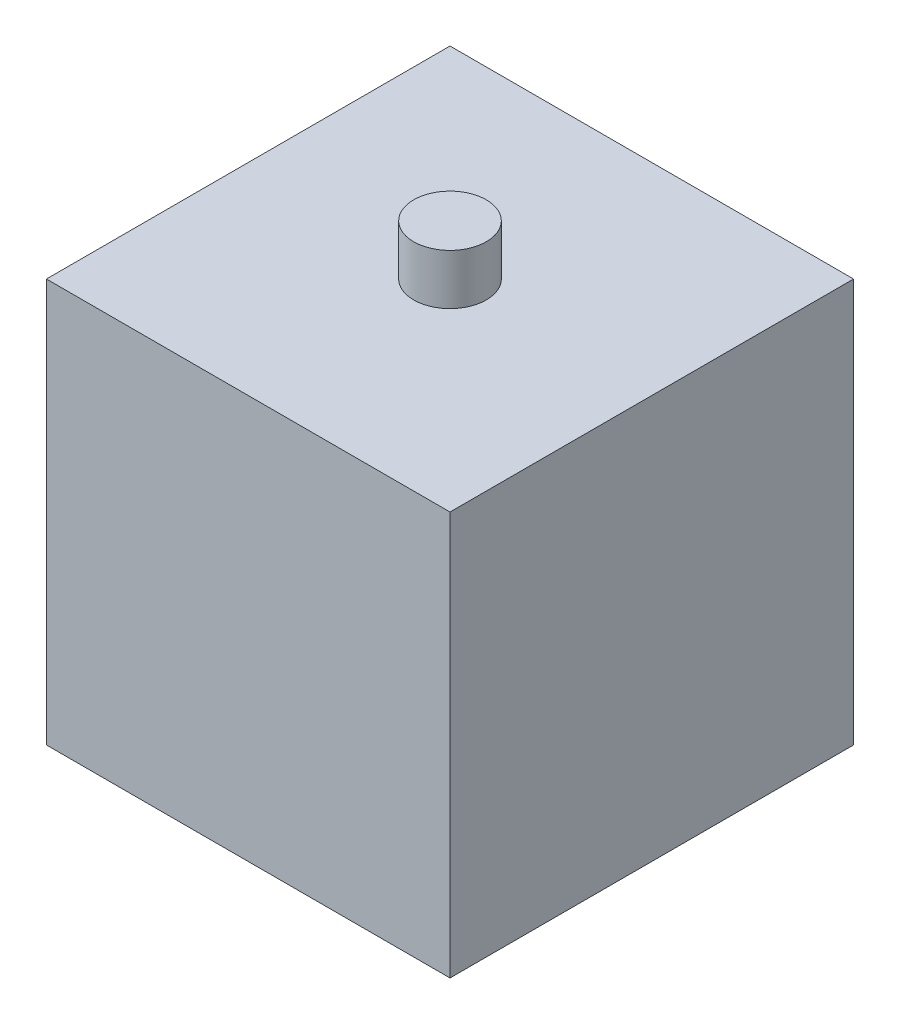
ISO-10303-21;
HEADER;
FILE_DESCRIPTION(('STEP AP214'),'2;1');
FILE_NAME('part.step','',(''),(''),'','','');
FILE_SCHEMA(('AUTOMOTIVE_DESIGN { 1 0 10303 214 1 1 1 1 }'));
ENDSEC;
DATA;
#1=APPLICATION_CONTEXT('core data for automotive mechanical design processes');
#2=APPLICATION_PROTOCOL_DEFINITION('international standard','automotive_design',2000,#1);
#3=PRODUCT_CONTEXT('',#1,'mechanical');
#4=PRODUCT('Part','Part','',(#3));
#5=PRODUCT_RELATED_PRODUCT_CATEGORY('part','',(#4));
#6=PRODUCT_DEFINITION_FORMATION('','',#4);
#7=PRODUCT_DEFINITION_CONTEXT('part definition',#1,'design');
#8=PRODUCT_DEFINITION('design','',#6,#7);
#9=PRODUCT_DEFINITION_SHAPE('','',#8);
#10=(LENGTH_UNIT() NAMED_UNIT(*) SI_UNIT(.MILLI.,.METRE.));
#11=(NAMED_UNIT(*) PLANE_ANGLE_UNIT() SI_UNIT($,.RADIAN.));
#12=(NAMED_UNIT(*) SI_UNIT($,.STERADIAN.) SOLID_ANGLE_UNIT());
#13=UNCERTAINTY_MEASURE_WITH_UNIT(LENGTH_MEASURE(1.E-05),#10,'distance_accuracy_value','');
#14=(GEOMETRIC_REPRESENTATION_CONTEXT(3) GLOBAL_UNCERTAINTY_ASSIGNED_CONTEXT((#13)) GLOBAL_UNIT_ASSIGNED_CONTEXT((#10,
#11,#12)) REPRESENTATION_CONTEXT('',''));
#15=CARTESIAN_POINT('',(0.,0.,0.));
#16=DIRECTION('',(0.,0.,1.));
#17=DIRECTION('',(1.,0.,0.));
#18=AXIS2_PLACEMENT_3D('',#15,#16,#17);
#19=CARTESIAN_POINT('',(-12.7,12.7,12.7));
#20=DIRECTION('',(0.,0.,-1.));
#21=DIRECTION('',(-1.,0.,0.));
#22=AXIS2_PLACEMENT_3D('',#19,#20,#21);
#23=PLANE('',#22);
#24=DIRECTION('',(1.,0.,0.));
#25=VECTOR('',#24,1.);
#26=CARTESIAN_POINT('',(-12.7,-12.7,12.7));
#27=LINE('',#26,#25);
#28=CARTESIAN_POINT('',(-12.7,-12.7,12.7));
#29=VERTEX_POINT('',#28);
#30=CARTESIAN_POINT('',(12.7,-12.7,12.7));
#31=VERTEX_POINT('',#30);
#32=EDGE_CURVE('E97',#29,#31,#27,.T.);
#33=ORIENTED_EDGE('',*,*,#32,.T.);
#34=DIRECTION('',(0.,-1.,0.));
#35=VECTOR('',#34,1.);
#36=CARTESIAN_POINT('',(12.7,12.7,12.7));
#37=LINE('',#36,#35);
#38=CARTESIAN_POINT('',(12.7,12.7,12.7));
#39=VERTEX_POINT('',#38);
#40=EDGE_CURVE('E11',#39,#31,#37,.T.);
#41=ORIENTED_EDGE('',*,*,#40,.F.);
#42=DIRECTION('',(1.,0.,0.));
#43=VECTOR('',#42,1.);
#44=CARTESIAN_POINT('',(-12.7,12.7,12.7));
#45=LINE('',#44,#43);
#46=CARTESIAN_POINT('',(-12.7,12.7,12.7));
#47=VERTEX_POINT('',#46);
#48=EDGE_CURVE('E83',#47,#39,#45,.T.);
#49=ORIENTED_EDGE('',*,*,#48,.F.);
#50=DIRECTION('',(0.,-1.,0.));
#51=VECTOR('',#50,1.);
#52=CARTESIAN_POINT('',(-12.7,12.7,12.7));
#53=LINE('',#52,#51);
#54=EDGE_CURVE('E50',#47,#29,#53,.T.);
#55=ORIENTED_EDGE('',*,*,#54,.T.);
#56=EDGE_LOOP('',(#33,#41,#49,#55));
#57=FACE_BOUND('',#56,.T.);
#58=ADVANCED_FACE('F34',(#57),#23,.F.);
#59=CARTESIAN_POINT('',(12.7,12.7,12.7));
#60=DIRECTION('',(-1.,0.,0.));
#61=DIRECTION('',(0.,0.,1.));
#62=AXIS2_PLACEMENT_3D('',#59,#60,#61);
#63=PLANE('',#62);
#64=DIRECTION('',(0.,0.,-1.));
#65=VECTOR('',#64,1.);
#66=CARTESIAN_POINT('',(12.7,-12.7,12.7));
#67=LINE('',#66,#65);
#68=CARTESIAN_POINT('',(12.7,-12.7,-12.7));
#69=VERTEX_POINT('',#68);
#70=EDGE_CURVE('E88',#31,#69,#67,.T.);
#71=ORIENTED_EDGE('',*,*,#70,.T.);
#72=DIRECTION('',(0.,-1.,0.));
#73=VECTOR('',#72,1.);
#74=CARTESIAN_POINT('',(12.7,12.7,-12.7));
#75=LINE('',#74,#73);
#76=CARTESIAN_POINT('',(12.7,12.7,-12.7));
#77=VERTEX_POINT('',#76);
#78=EDGE_CURVE('E42',#77,#69,#75,.T.);
#79=ORIENTED_EDGE('',*,*,#78,.F.);
#80=DIRECTION('',(0.,0.,-1.));
#81=VECTOR('',#80,1.);
#82=CARTESIAN_POINT('',(12.7,12.7,12.7));
#83=LINE('',#82,#81);
#84=EDGE_CURVE('E75',#39,#77,#83,.T.);
#85=ORIENTED_EDGE('',*,*,#84,.F.);
#86=ORIENTED_EDGE('',*,*,#40,.T.);
#87=EDGE_LOOP('',(#71,#79,#85,#86));
#88=FACE_BOUND('',#87,.T.);
#89=ADVANCED_FACE('F87',(#88),#63,.F.);
#90=CARTESIAN_POINT('',(-12.7,12.7,-12.7));
#91=DIRECTION('',(0.,0.,-1.));
#92=DIRECTION('',(-1.,0.,0.));
#93=AXIS2_PLACEMENT_3D('',#90,#91,#92);
#94=PLANE('',#93);
#95=DIRECTION('',(1.,0.,0.));
#96=VECTOR('',#95,1.);
#97=CARTESIAN_POINT('',(-12.7,-12.7,-12.7));
#98=LINE('',#97,#96);
#99=CARTESIAN_POINT('',(-12.7,-12.7,-12.7));
#100=VERTEX_POINT('',#99);
#101=EDGE_CURVE('E101',#100,#69,#98,.T.);
#102=ORIENTED_EDGE('',*,*,#101,.F.);
#103=DIRECTION('',(0.,-1.,0.));
#104=VECTOR('',#103,1.);
#105=CARTESIAN_POINT('',(-12.7,12.7,-12.7));
#106=LINE('',#105,#104);
#107=CARTESIAN_POINT('',(-12.7,12.7,-12.7));
#108=VERTEX_POINT('',#107);
#109=EDGE_CURVE('E64',#108,#100,#106,.T.);
#110=ORIENTED_EDGE('',*,*,#109,.F.);
#111=DIRECTION('',(1.,0.,0.));
#112=VECTOR('',#111,1.);
#113=CARTESIAN_POINT('',(-12.7,12.7,-12.7));
#114=LINE('',#113,#112);
#115=EDGE_CURVE('E82',#108,#77,#114,.T.);
#116=ORIENTED_EDGE('',*,*,#115,.T.);
#117=ORIENTED_EDGE('',*,*,#78,.T.);
#118=EDGE_LOOP('',(#102,#110,#116,#117));
#119=FACE_BOUND('',#118,.T.);
#120=ADVANCED_FACE('F91',(#119),#94,.T.);
#121=CARTESIAN_POINT('',(-12.7,12.7,12.7));
#122=DIRECTION('',(-1.,0.,0.));
#123=DIRECTION('',(0.,0.,1.));
#124=AXIS2_PLACEMENT_3D('',#121,#122,#123);
#125=PLANE('',#124);
#126=DIRECTION('',(0.,0.,-1.));
#127=VECTOR('',#126,1.);
#128=CARTESIAN_POINT('',(-12.7,-12.7,12.7));
#129=LINE('',#128,#127);
#130=EDGE_CURVE('E103',#29,#100,#129,.T.);
#131=ORIENTED_EDGE('',*,*,#130,.F.);
#132=ORIENTED_EDGE('',*,*,#54,.F.);
#133=DIRECTION('',(0.,0.,-1.));
#134=VECTOR('',#133,1.);
#135=CARTESIAN_POINT('',(-12.7,12.7,12.7));
#136=LINE('',#135,#134);
#137=EDGE_CURVE('E92',#47,#108,#136,.T.);
#138=ORIENTED_EDGE('',*,*,#137,.T.);
#139=ORIENTED_EDGE('',*,*,#109,.T.);
#140=EDGE_LOOP('',(#131,#132,#138,#139));
#141=FACE_BOUND('',#140,.T.);
#142=ADVANCED_FACE('F125',(#141),#125,.T.);
#143=CARTESIAN_POINT('',(0.,12.7,0.));
#144=DIRECTION('',(0.,1.,0.));
#145=DIRECTION('',(0.,0.,1.));
#146=AXIS2_PLACEMENT_3D('',#143,#144,#145);
#147=PLANE('',#146);
#148=CARTESIAN_POINT('',(0.,12.7,0.));
#149=DIRECTION('',(0.,1.,0.));
#150=DIRECTION('',(0.,0.,1.));
#151=AXIS2_PLACEMENT_3D('',#148,#149,#150);
#152=CIRCLE('',#151,2.286);
#153=CARTESIAN_POINT('',(0.,12.7,2.286));
#154=VERTEX_POINT('',#153);
#155=EDGE_CURVE('E109',#154,#154,#152,.T.);
#156=ORIENTED_EDGE('',*,*,#155,.F.);
#157=EDGE_LOOP('',(#156));
#158=FACE_BOUND('',#157,.T.);
#159=ORIENTED_EDGE('',*,*,#48,.T.);
#160=ORIENTED_EDGE('',*,*,#84,.T.);
#161=ORIENTED_EDGE('',*,*,#115,.F.);
#162=ORIENTED_EDGE('',*,*,#137,.F.);
#163=EDGE_LOOP('',(#159,#160,#161,#162));
#164=FACE_BOUND('',#163,.T.);
#165=ADVANCED_FACE('F79',(#158,#164),#147,.T.);
#166=CARTESIAN_POINT('',(0.,-12.7,0.));
#167=DIRECTION('',(0.,1.,0.));
#168=DIRECTION('',(0.,0.,1.));
#169=AXIS2_PLACEMENT_3D('',#166,#167,#168);
#170=PLANE('',#169);
#171=ORIENTED_EDGE('',*,*,#32,.F.);
#172=ORIENTED_EDGE('',*,*,#130,.T.);
#173=ORIENTED_EDGE('',*,*,#101,.T.);
#174=ORIENTED_EDGE('',*,*,#70,.F.);
#175=EDGE_LOOP('',(#171,#172,#173,#174));
#176=FACE_BOUND('',#175,.T.);
#177=ADVANCED_FACE('F120',(#176),#170,.F.);
#178=CARTESIAN_POINT('',(0.,15.875,0.));
#179=DIRECTION('',(0.,-1.,0.));
#180=DIRECTION('',(0.,0.,-1.));
#181=AXIS2_PLACEMENT_3D('',#178,#179,#180);
#182=CYLINDRICAL_SURFACE('',#181,2.286);
#183=CARTESIAN_POINT('',(0.,15.875,0.));
#184=DIRECTION('',(0.,1.,0.));
#185=DIRECTION('',(0.,0.,1.));
#186=AXIS2_PLACEMENT_3D('',#183,#184,#185);
#187=CIRCLE('',#186,2.286);
#188=CARTESIAN_POINT('',(0.,15.875,2.286));
#189=VERTEX_POINT('',#188);
#190=EDGE_CURVE('E99',#189,#189,#187,.T.);
#191=ORIENTED_EDGE('',*,*,#190,.F.);
#192=EDGE_LOOP('',(#191));
#193=FACE_BOUND('',#192,.T.);
#194=ORIENTED_EDGE('',*,*,#155,.T.);
#195=EDGE_LOOP('',(#194));
#196=FACE_BOUND('',#195,.T.);
#197=ADVANCED_FACE('F117',(#193,#196),#182,.T.);
#198=CARTESIAN_POINT('',(0.,15.875,0.));
#199=DIRECTION('',(0.,1.,0.));
#200=DIRECTION('',(0.,0.,1.));
#201=AXIS2_PLACEMENT_3D('',#198,#199,#200);
#202=PLANE('',#201);
#203=ORIENTED_EDGE('',*,*,#190,.T.);
#204=EDGE_LOOP('',(#203));
#205=FACE_BOUND('',#204,.T.);
#206=ADVANCED_FACE('F115',(#205),#202,.T.);
#207=CLOSED_SHELL('',(#58,#89,#120,#142,#165,#177,#197,#206));
#208=MANIFOLD_SOLID_BREP('B2',#207);
#209=ADVANCED_BREP_SHAPE_REPRESENTATION('',(#18,#208),#14);
#210=SHAPE_DEFINITION_REPRESENTATION(#9,#209);
ENDSEC;
END-ISO-10303-21;
